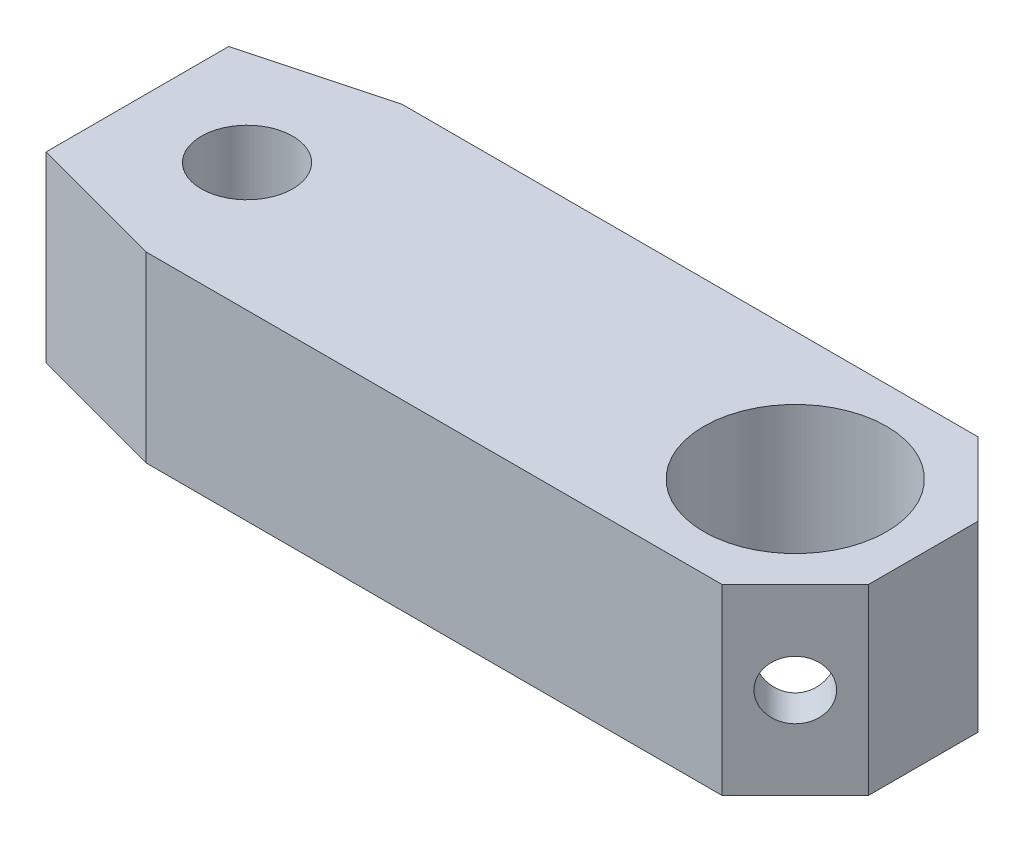
ISO-10303-21;
HEADER;
FILE_DESCRIPTION(('STEP AP214'),'2;1');
FILE_NAME('part.step','',(''),(''),'','','');
FILE_SCHEMA(('AUTOMOTIVE_DESIGN { 1 0 10303 214 1 1 1 1 }'));
ENDSEC;
DATA;
#1=APPLICATION_CONTEXT('core data for automotive mechanical design processes');
#2=APPLICATION_PROTOCOL_DEFINITION('international standard','automotive_design',2000,#1);
#3=PRODUCT_CONTEXT('',#1,'mechanical');
#4=PRODUCT('Part','Part','',(#3));
#5=PRODUCT_RELATED_PRODUCT_CATEGORY('part','',(#4));
#6=PRODUCT_DEFINITION_FORMATION('','',#4);
#7=PRODUCT_DEFINITION_CONTEXT('part definition',#1,'design');
#8=PRODUCT_DEFINITION('design','',#6,#7);
#9=PRODUCT_DEFINITION_SHAPE('','',#8);
#10=(LENGTH_UNIT() NAMED_UNIT(*) SI_UNIT(.MILLI.,.METRE.));
#11=(NAMED_UNIT(*) PLANE_ANGLE_UNIT() SI_UNIT($,.RADIAN.));
#12=(NAMED_UNIT(*) SI_UNIT($,.STERADIAN.) SOLID_ANGLE_UNIT());
#13=UNCERTAINTY_MEASURE_WITH_UNIT(LENGTH_MEASURE(1.E-05),#10,'distance_accuracy_value','');
#14=(GEOMETRIC_REPRESENTATION_CONTEXT(3) GLOBAL_UNCERTAINTY_ASSIGNED_CONTEXT((#13)) GLOBAL_UNIT_ASSIGNED_CONTEXT((#10,
#11,#12)) REPRESENTATION_CONTEXT('',''));
#15=CARTESIAN_POINT('',(0.,0.,0.));
#16=DIRECTION('',(0.,0.,1.));
#17=DIRECTION('',(1.,0.,0.));
#18=AXIS2_PLACEMENT_3D('',#15,#16,#17);
#19=CARTESIAN_POINT('',(10.,-5.,-10.));
#20=DIRECTION('',(-0.707106781186548,0.,0.707106781186547));
#21=DIRECTION('',(0.707106781186547,0.,0.707106781186548));
#22=AXIS2_PLACEMENT_3D('',#19,#20,#21);
#23=PLANE('',#22);
#24=DIRECTION('',(0.707106781186547,0.,0.707106781186548));
#25=VECTOR('',#24,1.);
#26=CARTESIAN_POINT('',(10.,0.,-10.));
#27=LINE('',#26,#25);
#28=CARTESIAN_POINT('',(16.5,0.,-3.5));
#29=VERTEX_POINT('',#28);
#30=CARTESIAN_POINT('',(18.5,0.,-1.5));
#31=VERTEX_POINT('',#30);
#32=EDGE_CURVE('E150',#29,#31,#27,.T.);
#33=ORIENTED_EDGE('',*,*,#32,.T.);
#34=DIRECTION('',(0.,1.,0.));
#35=VECTOR('',#34,1.);
#36=CARTESIAN_POINT('',(18.5,-5.,-1.5));
#37=LINE('',#36,#35);
#38=CARTESIAN_POINT('',(18.5,-5.,-1.5));
#39=VERTEX_POINT('',#38);
#40=EDGE_CURVE('E168',#39,#31,#37,.T.);
#41=ORIENTED_EDGE('',*,*,#40,.F.);
#42=DIRECTION('',(0.707106781186547,0.,0.707106781186548));
#43=VECTOR('',#42,1.);
#44=CARTESIAN_POINT('',(10.,-5.,-10.));
#45=LINE('',#44,#43);
#46=CARTESIAN_POINT('',(16.5,-5.,-3.5));
#47=VERTEX_POINT('',#46);
#48=EDGE_CURVE('E132',#47,#39,#45,.T.);
#49=ORIENTED_EDGE('',*,*,#48,.F.);
#50=DIRECTION('',(0.,1.,0.));
#51=VECTOR('',#50,1.);
#52=CARTESIAN_POINT('',(16.5,-5.,-3.5));
#53=LINE('',#52,#51);
#54=EDGE_CURVE('E165',#47,#29,#53,.T.);
#55=ORIENTED_EDGE('',*,*,#54,.T.);
#56=EDGE_LOOP('',(#33,#41,#49,#55));
#57=FACE_BOUND('',#56,.T.);
#58=CARTESIAN_POINT('',(17.5,-2.5,-2.5));
#59=DIRECTION('',(0.707106781186549,0.,-0.707106781186546));
#60=DIRECTION('',(-0.707106781186546,0.,-0.707106781186549));
#61=AXIS2_PLACEMENT_3D('',#58,#59,#60);
#62=CIRCLE('',#61,0.799999999999998);
#63=CARTESIAN_POINT('',(16.9343145750508,-2.5,-3.06568542494924));
#64=VERTEX_POINT('',#63);
#65=EDGE_CURVE('E216',#64,#64,#62,.T.);
#66=ORIENTED_EDGE('',*,*,#65,.F.);
#67=EDGE_LOOP('',(#66));
#68=FACE_BOUND('',#67,.T.);
#69=ADVANCED_FACE('F39',(#57,#68),#23,.F.);
#70=CARTESIAN_POINT('',(0.,-5.,3.5));
#71=DIRECTION('',(0.,0.,1.));
#72=DIRECTION('',(1.,0.,0.));
#73=AXIS2_PLACEMENT_3D('',#70,#71,#72);
#74=PLANE('',#73);
#75=DIRECTION('',(1.,0.,0.));
#76=VECTOR('',#75,1.);
#77=CARTESIAN_POINT('',(0.,0.,3.5));
#78=LINE('',#77,#76);
#79=CARTESIAN_POINT('',(0.732050807568831,0.,3.5));
#80=VERTEX_POINT('',#79);
#81=CARTESIAN_POINT('',(16.5,0.,3.5));
#82=VERTEX_POINT('',#81);
#83=EDGE_CURVE('E140',#80,#82,#78,.T.);
#84=ORIENTED_EDGE('',*,*,#83,.F.);
#85=DIRECTION('',(0.,1.,0.));
#86=VECTOR('',#85,1.);
#87=CARTESIAN_POINT('',(0.732050807568831,-5.,3.5));
#88=LINE('',#87,#86);
#89=CARTESIAN_POINT('',(0.732050807568831,-5.,3.5));
#90=VERTEX_POINT('',#89);
#91=EDGE_CURVE('E11',#90,#80,#88,.T.);
#92=ORIENTED_EDGE('',*,*,#91,.F.);
#93=DIRECTION('',(1.,0.,0.));
#94=VECTOR('',#93,1.);
#95=CARTESIAN_POINT('',(0.,-5.,3.5));
#96=LINE('',#95,#94);
#97=CARTESIAN_POINT('',(16.5,-5.,3.5));
#98=VERTEX_POINT('',#97);
#99=EDGE_CURVE('E173',#90,#98,#96,.T.);
#100=ORIENTED_EDGE('',*,*,#99,.T.);
#101=DIRECTION('',(0.,1.,0.));
#102=VECTOR('',#101,1.);
#103=CARTESIAN_POINT('',(16.5,-5.,3.5));
#104=LINE('',#103,#102);
#105=EDGE_CURVE('E43',#98,#82,#104,.T.);
#106=ORIENTED_EDGE('',*,*,#105,.T.);
#107=EDGE_LOOP('',(#84,#92,#100,#106));
#108=FACE_BOUND('',#107,.T.);
#109=ADVANCED_FACE('F172',(#108),#74,.T.);
#110=CARTESIAN_POINT('',(-0.825961894323354,-5.,3.08253175473055));
#111=DIRECTION('',(-0.258819045102524,0.,0.965925826289068));
#112=DIRECTION('',(0.965925826289068,0.,0.258819045102524));
#113=AXIS2_PLACEMENT_3D('',#110,#111,#112);
#114=PLANE('',#113);
#115=DIRECTION('',(0.965925826289068,0.,0.258819045102524));
#116=VECTOR('',#115,1.);
#117=CARTESIAN_POINT('',(-0.825961894323354,0.,3.08253175473055));
#118=LINE('',#117,#116);
#119=CARTESIAN_POINT('',(-3.,0.,2.5));
#120=VERTEX_POINT('',#119);
#121=EDGE_CURVE('E159',#120,#80,#118,.T.);
#122=ORIENTED_EDGE('',*,*,#121,.F.);
#123=DIRECTION('',(0.,1.,0.));
#124=VECTOR('',#123,1.);
#125=CARTESIAN_POINT('',(-3.,-5.,2.5));
#126=LINE('',#125,#124);
#127=CARTESIAN_POINT('',(-3.,-5.,2.5));
#128=VERTEX_POINT('',#127);
#129=EDGE_CURVE('E49',#128,#120,#126,.T.);
#130=ORIENTED_EDGE('',*,*,#129,.F.);
#131=DIRECTION('',(0.965925826289068,0.,0.258819045102524));
#132=VECTOR('',#131,1.);
#133=CARTESIAN_POINT('',(-0.825961894323354,-5.,3.08253175473055));
#134=LINE('',#133,#132);
#135=EDGE_CURVE('E126',#128,#90,#134,.T.);
#136=ORIENTED_EDGE('',*,*,#135,.T.);
#137=ORIENTED_EDGE('',*,*,#91,.T.);
#138=EDGE_LOOP('',(#122,#130,#136,#137));
#139=FACE_BOUND('',#138,.T.);
#140=ADVANCED_FACE('F177',(#139),#114,.T.);
#141=CARTESIAN_POINT('',(-3.,-5.,0.));
#142=DIRECTION('',(-1.,0.,0.));
#143=DIRECTION('',(0.,0.,1.));
#144=AXIS2_PLACEMENT_3D('',#141,#142,#143);
#145=PLANE('',#144);
#146=DIRECTION('',(0.,0.,1.));
#147=VECTOR('',#146,1.);
#148=CARTESIAN_POINT('',(-3.,0.,0.));
#149=LINE('',#148,#147);
#150=CARTESIAN_POINT('',(-3.,0.,-2.5));
#151=VERTEX_POINT('',#150);
#152=EDGE_CURVE('E114',#151,#120,#149,.T.);
#153=ORIENTED_EDGE('',*,*,#152,.F.);
#154=DIRECTION('',(0.,1.,0.));
#155=VECTOR('',#154,1.);
#156=CARTESIAN_POINT('',(-3.,-5.,-2.5));
#157=LINE('',#156,#155);
#158=CARTESIAN_POINT('',(-3.,-5.,-2.5));
#159=VERTEX_POINT('',#158);
#160=EDGE_CURVE('E109',#159,#151,#157,.T.);
#161=ORIENTED_EDGE('',*,*,#160,.F.);
#162=DIRECTION('',(0.,0.,1.));
#163=VECTOR('',#162,1.);
#164=CARTESIAN_POINT('',(-3.,-5.,0.));
#165=LINE('',#164,#163);
#166=EDGE_CURVE('E112',#159,#128,#165,.T.);
#167=ORIENTED_EDGE('',*,*,#166,.T.);
#168=ORIENTED_EDGE('',*,*,#129,.T.);
#169=EDGE_LOOP('',(#153,#161,#167,#168));
#170=FACE_BOUND('',#169,.T.);
#171=ADVANCED_FACE('F111',(#170),#145,.T.);
#172=CARTESIAN_POINT('',(-0.825961894323355,-5.,-3.08253175473055));
#173=DIRECTION('',(-0.258819045102524,0.,-0.965925826289068));
#174=DIRECTION('',(-0.965925826289068,0.,0.258819045102524));
#175=AXIS2_PLACEMENT_3D('',#172,#173,#174);
#176=PLANE('',#175);
#177=DIRECTION('',(-0.965925826289067,0.,0.258819045102524));
#178=VECTOR('',#177,1.);
#179=CARTESIAN_POINT('',(-0.825961894323355,0.,-3.08253175473055));
#180=LINE('',#179,#178);
#181=CARTESIAN_POINT('',(0.732050807568824,0.,-3.5));
#182=VERTEX_POINT('',#181);
#183=EDGE_CURVE('E156',#182,#151,#180,.T.);
#184=ORIENTED_EDGE('',*,*,#183,.F.);
#185=DIRECTION('',(0.,1.,0.));
#186=VECTOR('',#185,1.);
#187=CARTESIAN_POINT('',(0.732050807568824,-5.,-3.5));
#188=LINE('',#187,#186);
#189=CARTESIAN_POINT('',(0.732050807568824,-5.,-3.5));
#190=VERTEX_POINT('',#189);
#191=EDGE_CURVE('E119',#190,#182,#188,.T.);
#192=ORIENTED_EDGE('',*,*,#191,.F.);
#193=DIRECTION('',(-0.965925826289067,0.,0.258819045102524));
#194=VECTOR('',#193,1.);
#195=CARTESIAN_POINT('',(-0.825961894323355,-5.,-3.08253175473055));
#196=LINE('',#195,#194);
#197=EDGE_CURVE('E125',#190,#159,#196,.T.);
#198=ORIENTED_EDGE('',*,*,#197,.T.);
#199=ORIENTED_EDGE('',*,*,#160,.T.);
#200=EDGE_LOOP('',(#184,#192,#198,#199));
#201=FACE_BOUND('',#200,.T.);
#202=ADVANCED_FACE('F128',(#201),#176,.T.);
#203=CARTESIAN_POINT('',(0.,-5.,-3.5));
#204=DIRECTION('',(0.,0.,1.));
#205=DIRECTION('',(1.,0.,0.));
#206=AXIS2_PLACEMENT_3D('',#203,#204,#205);
#207=PLANE('',#206);
#208=DIRECTION('',(1.,0.,0.));
#209=VECTOR('',#208,1.);
#210=CARTESIAN_POINT('',(0.,0.,-3.5));
#211=LINE('',#210,#209);
#212=EDGE_CURVE('E153',#182,#29,#211,.T.);
#213=ORIENTED_EDGE('',*,*,#212,.T.);
#214=ORIENTED_EDGE('',*,*,#54,.F.);
#215=DIRECTION('',(1.,0.,0.));
#216=VECTOR('',#215,1.);
#217=CARTESIAN_POINT('',(0.,-5.,-3.5));
#218=LINE('',#217,#216);
#219=EDGE_CURVE('E130',#190,#47,#218,.T.);
#220=ORIENTED_EDGE('',*,*,#219,.F.);
#221=ORIENTED_EDGE('',*,*,#191,.T.);
#222=EDGE_LOOP('',(#213,#214,#220,#221));
#223=FACE_BOUND('',#222,.T.);
#224=ADVANCED_FACE('F194',(#223),#207,.F.);
#225=CARTESIAN_POINT('',(18.5,-5.,0.));
#226=DIRECTION('',(-1.,0.,0.));
#227=DIRECTION('',(0.,0.,1.));
#228=AXIS2_PLACEMENT_3D('',#225,#226,#227);
#229=PLANE('',#228);
#230=DIRECTION('',(0.,0.,1.));
#231=VECTOR('',#230,1.);
#232=CARTESIAN_POINT('',(18.5,0.,0.));
#233=LINE('',#232,#231);
#234=CARTESIAN_POINT('',(18.5,0.,1.50000000000001));
#235=VERTEX_POINT('',#234);
#236=EDGE_CURVE('E147',#31,#235,#233,.T.);
#237=ORIENTED_EDGE('',*,*,#236,.T.);
#238=DIRECTION('',(0.,1.,0.));
#239=VECTOR('',#238,1.);
#240=CARTESIAN_POINT('',(18.5,-5.,1.50000000000001));
#241=LINE('',#240,#239);
#242=CARTESIAN_POINT('',(18.5,-5.,1.50000000000001));
#243=VERTEX_POINT('',#242);
#244=EDGE_CURVE('E170',#243,#235,#241,.T.);
#245=ORIENTED_EDGE('',*,*,#244,.F.);
#246=DIRECTION('',(0.,0.,1.));
#247=VECTOR('',#246,1.);
#248=CARTESIAN_POINT('',(18.5,-5.,0.));
#249=LINE('',#248,#247);
#250=EDGE_CURVE('E272',#39,#243,#249,.T.);
#251=ORIENTED_EDGE('',*,*,#250,.F.);
#252=ORIENTED_EDGE('',*,*,#40,.T.);
#253=EDGE_LOOP('',(#237,#245,#251,#252));
#254=FACE_BOUND('',#253,.T.);
#255=ADVANCED_FACE('F196',(#254),#229,.F.);
#256=CARTESIAN_POINT('',(15.,-5.,0.));
#257=DIRECTION('',(0.,1.,0.));
#258=DIRECTION('',(0.,0.,1.));
#259=AXIS2_PLACEMENT_3D('',#256,#257,#258);
#260=CYLINDRICAL_SURFACE('',#259,2.5);
#261=CARTESIAN_POINT('',(17.2404988473937,-2.5,1.10912799749519));
#262=CARTESIAN_POINT('',(17.2404988541167,-2.4563168810223,1.10912818541871));
#263=CARTESIAN_POINT('',(17.2388241767648,-2.41263224816393,1.1125304018607));
#264=CARTESIAN_POINT('',(17.232113868879,-2.32655020622629,1.12593179470893));
#265=CARTESIAN_POINT('',(17.2270774585958,-2.28415309817247,1.13593250161976));
#266=CARTESIAN_POINT('',(17.2136215489733,-2.20190594916675,1.16193440751882));
#267=CARTESIAN_POINT('',(17.2052082599999,-2.16205138734552,1.17792458777334));
#268=CARTESIAN_POINT('',(17.1849436904651,-2.08579117949244,1.21509982738939));
#269=CARTESIAN_POINT('',(17.1730917474474,-2.0493861998166,1.23628588761476));
#270=CARTESIAN_POINT('',(17.1454440363891,-1.97974680243317,1.2836842202225));
#271=CARTESIAN_POINT('',(17.1295320197195,-1.94665491726237,1.31003814826472));
#272=CARTESIAN_POINT('',(17.0939436171637,-1.88585678706832,1.36620054517443));
#273=CARTESIAN_POINT('',(17.0742666794856,-1.85815133268898,1.3960095201654));
#274=CARTESIAN_POINT('',(17.0306971684241,-1.80827730734993,1.45868354616379));
#275=CARTESIAN_POINT('',(17.0067153046472,-1.78625642534535,1.4916044987244));
#276=CARTESIAN_POINT('',(16.9551367795838,-1.7493507180172,1.55859681671745));
#277=CARTESIAN_POINT('',(16.9275410137925,-1.73446412911867,1.5926678956108));
#278=CARTESIAN_POINT('',(16.8702109889945,-1.71272811038582,1.65957469045755));
#279=CARTESIAN_POINT('',(16.84057444976,-1.7056348711692,1.69241479802919));
#280=CARTESIAN_POINT('',(16.7791781047093,-1.69891344724945,1.7568447522647));
#281=CARTESIAN_POINT('',(16.7474188061002,-1.6992834855991,1.78843489474068));
#282=CARTESIAN_POINT('',(16.683936611475,-1.70731975098619,1.84829473803465));
#283=CARTESIAN_POINT('',(16.6522539768443,-1.71472149892031,1.87664322380571));
#284=CARTESIAN_POINT('',(16.5888369923934,-1.73617591162057,1.93062999064361));
#285=CARTESIAN_POINT('',(16.5571026392871,-1.75022901682797,1.95626809209598));
#286=CARTESIAN_POINT('',(16.4942370738243,-1.78475161625891,2.00470732303012));
#287=CARTESIAN_POINT('',(16.4631184679375,-1.80529959079679,2.02746871397409));
#288=CARTESIAN_POINT('',(16.4029661086455,-1.85216510344927,2.06954961660544));
#289=CARTESIAN_POINT('',(16.3739329043215,-1.8784841537353,2.08886822378477));
#290=CARTESIAN_POINT('',(16.3177886514939,-1.93749382086661,2.12475695925679));
#291=CARTESIAN_POINT('',(16.2908165726072,-1.97041218152882,2.14117055718036));
#292=CARTESIAN_POINT('',(16.2414015320426,-2.04099413048974,2.17019482644184));
#293=CARTESIAN_POINT('',(16.2189591592858,-2.0786583347775,2.18280500339054));
#294=CARTESIAN_POINT('',(16.1794287718536,-2.15827837014686,2.20441911446709));
#295=CARTESIAN_POINT('',(16.16240956869,-2.20028103768846,2.21337707737416));
#296=CARTESIAN_POINT('',(16.1350682749203,-2.28701040319528,2.2275232326676));
#297=CARTESIAN_POINT('',(16.1247436385431,-2.33173605859247,2.23271285814559));
#298=CARTESIAN_POINT('',(16.1117173070573,-2.4206319550402,2.23922659867746));
#299=CARTESIAN_POINT('',(16.1087140765745,-2.4647468241569,2.24070369973722));
#300=CARTESIAN_POINT('',(16.1096337901048,-2.55288213526822,2.24024851592345));
#301=CARTESIAN_POINT('',(16.1135555993644,-2.59690259155014,2.23831678962858));
#302=CARTESIAN_POINT('',(16.1278531023916,-2.68218851367629,2.23114483636998));
#303=CARTESIAN_POINT('',(16.1380263436639,-2.7234970733505,2.22600831940711));
#304=CARTESIAN_POINT('',(16.1640915190041,-2.80370557986887,2.21248842478181));
#305=CARTESIAN_POINT('',(16.1799844152127,-2.84260512018495,2.20410450083366));
#306=CARTESIAN_POINT('',(16.2172718927272,-2.91817392358121,2.18373807606431));
#307=CARTESIAN_POINT('',(16.2388162112165,-2.95474227940474,2.17165585061502));
#308=CARTESIAN_POINT('',(16.2862014947658,-3.02348671109181,2.14393050396678));
#309=CARTESIAN_POINT('',(16.3120436293921,-3.05566158700413,2.12828641304743));
#310=CARTESIAN_POINT('',(16.3682106614373,-3.11615955531712,2.0926422503481));
#311=CARTESIAN_POINT('',(16.3986822651239,-3.14425240079187,2.07248148247199));
#312=CARTESIAN_POINT('',(16.4619856153365,-3.19404253863835,2.02832079001999));
#313=CARTESIAN_POINT('',(16.4948172610245,-3.21574010406074,2.00432102941991));
#314=CARTESIAN_POINT('',(16.5613480340638,-3.25191799863386,1.9529322867102));
#315=CARTESIAN_POINT('',(16.5950392344851,-3.26644905920689,1.9255688928008));
#316=CARTESIAN_POINT('',(16.6622575220946,-3.28799205205537,1.86784880658013));
#317=CARTESIAN_POINT('',(16.6957846597637,-3.29500646366345,1.83749310487792));
#318=CARTESIAN_POINT('',(16.7600580359578,-3.30110785394987,1.77597545873001));
#319=CARTESIAN_POINT('',(16.7908617970982,-3.30052665751495,1.74490614639337));
#320=CARTESIAN_POINT('',(16.8503422443139,-3.29226145761088,1.68170050288552));
#321=CARTESIAN_POINT('',(16.8790190805558,-3.28457795609982,1.64956424727568));
#322=CARTESIAN_POINT('',(16.9331918914688,-3.26254086461702,1.58571746846321));
#323=CARTESIAN_POINT('',(16.9587259629554,-3.24827981377716,1.55400712571505));
#324=CARTESIAN_POINT('',(17.0066494650578,-3.21357669521386,1.49161230484144));
#325=CARTESIAN_POINT('',(17.0290383434733,-3.19313354408271,1.46092800757718));
#326=CARTESIAN_POINT('',(17.0711806033031,-3.14581944610727,1.40057618973544));
#327=CARTESIAN_POINT('',(17.0908141582918,-3.11874838189769,1.37098196334065));
#328=CARTESIAN_POINT('',(17.126412589917,-3.05929536207991,1.31509297148735));
#329=CARTESIAN_POINT('',(17.1423763395129,-3.02691178015333,1.28879922076634));
#330=CARTESIAN_POINT('',(17.1711562714463,-2.95638667718153,1.23972554536212));
#331=CARTESIAN_POINT('',(17.1838417540485,-2.91808249896281,1.21710204417814));
#332=CARTESIAN_POINT('',(17.2053683159992,-2.83760764716501,1.1776495007583));
#333=CARTESIAN_POINT('',(17.2142107619253,-2.79543835448412,1.16081839919842));
#334=CARTESIAN_POINT('',(17.2276249198159,-2.71150857944311,1.1348507413015));
#335=CARTESIAN_POINT('',(17.2324556973834,-2.66993242204363,1.12525198200641));
#336=CARTESIAN_POINT('',(17.2388922089384,-2.58557110057192,1.11239140019805));
#337=CARTESIAN_POINT('',(17.2404988408087,-2.54278627646441,1.10912781342986));
#338=CARTESIAN_POINT('',(17.2404988473937,-2.5,1.10912799749519));
#339=B_SPLINE_CURVE_WITH_KNOTS('',3,(#261,#262,#263,#264,#265,#266,#267,#268,#269,#270,#271,
#272,#273,#274,#275,#276,#277,#278,#279,#280,#281,#282,#283,#284,#285,#286,#287,#288,#289,#290,
#291,#292,#293,#294,#295,#296,#297,#298,#299,#300,#301,#302,#303,#304,#305,#306,#307,#308,#309,
#310,#311,#312,#313,#314,#315,#316,#317,#318,#319,#320,#321,#322,#323,#324,#325,#326,#327,#328,
#329,#330,#331,#332,#333,#334,#335,#336,#337,#338),.UNSPECIFIED.,.T.,.F.,(4,2,2,2,2,2,2,2,2,2,2,
2,2,2,2,2,2,2,2,2,2,2,2,2,2,2,2,2,2,2,2,2,2,2,2,2,2,2,4),(0.,0.130891168523663,
0.261812707628661,0.392494566159158,0.523201617269221,0.658181086047294,0.793180352769164,
0.931396887417822,1.06957923772489,1.20330337206031,1.33699566811544,1.46585063697654,
1.5947141395825,1.72519845034169,1.85571699231553,1.99192534158374,2.12815138832635,
2.26604280905129,2.40388176242564,2.53593995660066,2.66797651341177,2.79594728163428,
2.92393958672764,3.0557432663747,3.18758287266625,3.32519336185686,3.46279797482663,
3.59941398434423,3.73598491780592,3.86661026401423,3.99722637893302,4.12605842929881,
4.25491307046653,4.38828245677264,4.52169274783304,4.65980300496366,4.79786411004772,
4.92610371676323,5.05430760545675),.UNSPECIFIED.);
#340=CARTESIAN_POINT('',(17.2404988473937,-2.5,1.10912799749519));
#341=VERTEX_POINT('',#340);
#342=EDGE_CURVE('E213',#341,#341,#339,.T.);
#343=ORIENTED_EDGE('',*,*,#342,.T.);
#344=EDGE_LOOP('',(#343));
#345=FACE_BOUND('',#344,.T.);
#346=CARTESIAN_POINT('',(16.1091279974952,-2.5,-2.24049884739366));
#347=CARTESIAN_POINT('',(16.1091281854187,-2.4563168810223,-2.24049885411668));
#348=CARTESIAN_POINT('',(16.1125304018607,-2.41263224816393,-2.23882417676484));
#349=CARTESIAN_POINT('',(16.1259317947089,-2.32655020622629,-2.23211386887905));
#350=CARTESIAN_POINT('',(16.1359325016197,-2.28415309817247,-2.22707745859578));
#351=CARTESIAN_POINT('',(16.1619344075188,-2.20190594916675,-2.21362154897332));
#352=CARTESIAN_POINT('',(16.1779245877733,-2.16205138734552,-2.2052082599999));
#353=CARTESIAN_POINT('',(16.2150998273894,-2.08579117949244,-2.18494369046508));
#354=CARTESIAN_POINT('',(16.2362858876148,-2.0493861998166,-2.17309174744741));
#355=CARTESIAN_POINT('',(16.2836842202225,-1.97974680243317,-2.14544403638909));
#356=CARTESIAN_POINT('',(16.3100381482647,-1.94665491726237,-2.12953201971954));
#357=CARTESIAN_POINT('',(16.3662005451744,-1.88585678706832,-2.09394361716372));
#358=CARTESIAN_POINT('',(16.3960095201654,-1.85815133268898,-2.07426667948564));
#359=CARTESIAN_POINT('',(16.4586835461638,-1.80827730734993,-2.03069716842412));
#360=CARTESIAN_POINT('',(16.4916044987244,-1.78625642534535,-2.00671530464722));
#361=CARTESIAN_POINT('',(16.5585968167174,-1.74935071801721,-1.95513677958383));
#362=CARTESIAN_POINT('',(16.5926678956108,-1.73446412911867,-1.92754101379246));
#363=CARTESIAN_POINT('',(16.6595746904575,-1.71272811038582,-1.87021098899453));
#364=CARTESIAN_POINT('',(16.6924147980292,-1.7056348711692,-1.84057444976));
#365=CARTESIAN_POINT('',(16.7568447522647,-1.69891344724945,-1.77917810470935));
#366=CARTESIAN_POINT('',(16.7884348947407,-1.6992834855991,-1.74741880610021));
#367=CARTESIAN_POINT('',(16.8482947380346,-1.70731975098619,-1.68393661147496));
#368=CARTESIAN_POINT('',(16.8766432238057,-1.71472149892031,-1.65225397684429));
#369=CARTESIAN_POINT('',(16.9306299906436,-1.73617591162058,-1.58883699239339));
#370=CARTESIAN_POINT('',(16.956268092096,-1.75022901682797,-1.55710263928714));
#371=CARTESIAN_POINT('',(17.0047073230301,-1.78475161625891,-1.49423707382427));
#372=CARTESIAN_POINT('',(17.0274687139741,-1.80529959079679,-1.46311846793753));
#373=CARTESIAN_POINT('',(17.0695496166054,-1.85216510344927,-1.40296610864553));
#374=CARTESIAN_POINT('',(17.0888682237848,-1.8784841537353,-1.37393290432149));
#375=CARTESIAN_POINT('',(17.1247569592568,-1.93749382086661,-1.31778865149392));
#376=CARTESIAN_POINT('',(17.1411705571804,-1.97041218152882,-1.29081657260717));
#377=CARTESIAN_POINT('',(17.1701948264418,-2.04099413048974,-1.24140153204261));
#378=CARTESIAN_POINT('',(17.1828050033905,-2.0786583347775,-1.2189591592858));
#379=CARTESIAN_POINT('',(17.2044191144671,-2.15827837014686,-1.17942877185361));
#380=CARTESIAN_POINT('',(17.2133770773742,-2.20028103768846,-1.16240956869004));
#381=CARTESIAN_POINT('',(17.2275232326676,-2.28701040319528,-1.13506827492031));
#382=CARTESIAN_POINT('',(17.2327128581456,-2.33173605859247,-1.12474363854311));
#383=CARTESIAN_POINT('',(17.2392265986775,-2.4206319550402,-1.11171730705733));
#384=CARTESIAN_POINT('',(17.2407036997372,-2.4647468241569,-1.1087140765745));
#385=CARTESIAN_POINT('',(17.2402485159234,-2.55288213526821,-1.10963379010485));
#386=CARTESIAN_POINT('',(17.2383167896286,-2.59690259155014,-1.11355559936442));
#387=CARTESIAN_POINT('',(17.23114483637,-2.68218851367628,-1.12785310239162));
#388=CARTESIAN_POINT('',(17.2260083194071,-2.7234970733505,-1.13802634366389));
#389=CARTESIAN_POINT('',(17.2124884247818,-2.80370557986886,-1.16409151900411));
#390=CARTESIAN_POINT('',(17.2041045008337,-2.84260512018495,-1.17998441521267));
#391=CARTESIAN_POINT('',(17.1837380760643,-2.91817392358121,-1.21727189272725));
#392=CARTESIAN_POINT('',(17.171655850615,-2.95474227940474,-1.23881621121647));
#393=CARTESIAN_POINT('',(17.1439305039668,-3.02348671109181,-1.28620149476584));
#394=CARTESIAN_POINT('',(17.1282864130474,-3.05566158700413,-1.31204362939209));
#395=CARTESIAN_POINT('',(17.0926422503481,-3.11615955531712,-1.36821066143728));
#396=CARTESIAN_POINT('',(17.072481482472,-3.14425240079187,-1.3986822651239));
#397=CARTESIAN_POINT('',(17.02832079002,-3.19404253863835,-1.46198561533654));
#398=CARTESIAN_POINT('',(17.0043210294199,-3.21574010406074,-1.49481726102455));
#399=CARTESIAN_POINT('',(16.9529322867102,-3.25191799863386,-1.56134803406381));
#400=CARTESIAN_POINT('',(16.9255688928008,-3.26644905920689,-1.59503923448506));
#401=CARTESIAN_POINT('',(16.8678488065801,-3.28799205205537,-1.66225752209456));
#402=CARTESIAN_POINT('',(16.8374931048779,-3.29500646366345,-1.69578465976372));
#403=CARTESIAN_POINT('',(16.77597545873,-3.30110785394987,-1.76005803595779));
#404=CARTESIAN_POINT('',(16.7449061463934,-3.30052665751495,-1.79086179709819));
#405=CARTESIAN_POINT('',(16.6817005028855,-3.29226145761088,-1.85034224431393));
#406=CARTESIAN_POINT('',(16.6495642472757,-3.28457795609982,-1.87901908055577));
#407=CARTESIAN_POINT('',(16.5857174684632,-3.26254086461702,-1.9331918914688));
#408=CARTESIAN_POINT('',(16.554007125715,-3.24827981377717,-1.9587259629554));
#409=CARTESIAN_POINT('',(16.4916123048414,-3.21357669521386,-2.00664946505784));
#410=CARTESIAN_POINT('',(16.4609280075772,-3.19313354408271,-2.02903834347329));
#411=CARTESIAN_POINT('',(16.4005761897354,-3.14581944610727,-2.07118060330313));
#412=CARTESIAN_POINT('',(16.3709819633406,-3.11874838189769,-2.09081415829184));
#413=CARTESIAN_POINT('',(16.3150929714873,-3.05929536207992,-2.126412589917));
#414=CARTESIAN_POINT('',(16.2887992207663,-3.02691178015333,-2.14237633951295));
#415=CARTESIAN_POINT('',(16.2397255453621,-2.95638667718153,-2.17115627144635));
#416=CARTESIAN_POINT('',(16.2171020441781,-2.91808249896281,-2.18384175404855));
#417=CARTESIAN_POINT('',(16.1776495007583,-2.83760764716501,-2.20536831599921));
#418=CARTESIAN_POINT('',(16.1608183991984,-2.79543835448412,-2.21421076192526));
#419=CARTESIAN_POINT('',(16.1348507413015,-2.71150857944311,-2.22762491981589));
#420=CARTESIAN_POINT('',(16.1252519820064,-2.66993242204363,-2.23245569738337));
#421=CARTESIAN_POINT('',(16.112391400198,-2.58557110057192,-2.23889220893843));
#422=CARTESIAN_POINT('',(16.1091278134299,-2.54278627646441,-2.24049884080867));
#423=CARTESIAN_POINT('',(16.1091279974952,-2.5,-2.24049884739366));
#424=B_SPLINE_CURVE_WITH_KNOTS('',3,(#346,#347,#348,#349,#350,#351,#352,#353,#354,#355,#356,
#357,#358,#359,#360,#361,#362,#363,#364,#365,#366,#367,#368,#369,#370,#371,#372,#373,#374,#375,
#376,#377,#378,#379,#380,#381,#382,#383,#384,#385,#386,#387,#388,#389,#390,#391,#392,#393,#394,
#395,#396,#397,#398,#399,#400,#401,#402,#403,#404,#405,#406,#407,#408,#409,#410,#411,#412,#413,
#414,#415,#416,#417,#418,#419,#420,#421,#422,#423),.UNSPECIFIED.,.T.,.F.,(4,2,2,2,2,2,2,2,2,2,2,
2,2,2,2,2,2,2,2,2,2,2,2,2,2,2,2,2,2,2,2,2,2,2,2,2,2,2,4),(0.,0.130891168523662,0.26181270762866,
0.392494566159156,0.523201617269218,0.658181086047291,0.793180352769161,0.931396887417819,
1.06957923772489,1.20330337206031,1.33699566811544,1.46585063697655,1.5947141395825,
1.72519845034169,1.85571699231554,1.99192534158374,2.12815138832635,2.26604280905129,
2.40388176242564,2.53593995660066,2.66797651341177,2.79594728163428,2.92393958672764,
3.0557432663747,3.18758287266625,3.32519336185686,3.46279797482663,3.59941398434423,
3.73598491780592,3.86661026401423,3.99722637893302,4.12605842929881,4.25491307046653,
4.38828245677263,4.52169274783304,4.65980300496366,4.79786411004772,4.92610371676324,
5.05430760545675),.UNSPECIFIED.);
#425=CARTESIAN_POINT('',(16.1091279974952,-2.5,-2.24049884739366));
#426=VERTEX_POINT('',#425);
#427=EDGE_CURVE('E242',#426,#426,#424,.T.);
#428=ORIENTED_EDGE('',*,*,#427,.T.);
#429=EDGE_LOOP('',(#428));
#430=FACE_BOUND('',#429,.T.);
#431=CARTESIAN_POINT('',(15.,-5.,0.));
#432=DIRECTION('',(0.,1.,0.));
#433=DIRECTION('',(0.,0.,1.));
#434=AXIS2_PLACEMENT_3D('',#431,#432,#433);
#435=CIRCLE('',#434,2.5);
#436=CARTESIAN_POINT('',(15.,-5.,2.5));
#437=VERTEX_POINT('',#436);
#438=EDGE_CURVE('E161',#437,#437,#435,.T.);
#439=ORIENTED_EDGE('',*,*,#438,.F.);
#440=EDGE_LOOP('',(#439));
#441=FACE_BOUND('',#440,.T.);
#442=CARTESIAN_POINT('',(15.,0.,0.));
#443=DIRECTION('',(0.,1.,0.));
#444=DIRECTION('',(0.,0.,1.));
#445=AXIS2_PLACEMENT_3D('',#442,#443,#444);
#446=CIRCLE('',#445,2.5);
#447=CARTESIAN_POINT('',(15.,0.,2.5));
#448=VERTEX_POINT('',#447);
#449=EDGE_CURVE('E137',#448,#448,#446,.T.);
#450=ORIENTED_EDGE('',*,*,#449,.T.);
#451=EDGE_LOOP('',(#450));
#452=FACE_BOUND('',#451,.T.);
#453=ADVANCED_FACE('F41',(#345,#430,#441,#452),#260,.F.);
#454=CARTESIAN_POINT('',(9.99999999999996,-5.,10.));
#455=DIRECTION('',(0.707106781186546,0.,0.707106781186549));
#456=DIRECTION('',(0.707106781186549,0.,-0.707106781186546));
#457=AXIS2_PLACEMENT_3D('',#454,#455,#456);
#458=PLANE('',#457);
#459=CARTESIAN_POINT('',(17.5,-2.5,2.5));
#460=DIRECTION('',(0.707106781186549,0.,0.707106781186546));
#461=DIRECTION('',(0.707106781186546,0.,-0.707106781186549));
#462=AXIS2_PLACEMENT_3D('',#459,#460,#461);
#463=CIRCLE('',#462,0.799999999999998);
#464=CARTESIAN_POINT('',(18.0656854249492,-2.5,1.93431457505076));
#465=VERTEX_POINT('',#464);
#466=EDGE_CURVE('E211',#465,#465,#463,.T.);
#467=ORIENTED_EDGE('',*,*,#466,.F.);
#468=EDGE_LOOP('',(#467));
#469=FACE_BOUND('',#468,.T.);
#470=DIRECTION('',(0.707106781186549,0.,-0.707106781186546));
#471=VECTOR('',#470,1.);
#472=CARTESIAN_POINT('',(9.99999999999996,0.,10.));
#473=LINE('',#472,#471);
#474=EDGE_CURVE('E144',#82,#235,#473,.T.);
#475=ORIENTED_EDGE('',*,*,#474,.F.);
#476=ORIENTED_EDGE('',*,*,#105,.F.);
#477=DIRECTION('',(0.707106781186549,0.,-0.707106781186546));
#478=VECTOR('',#477,1.);
#479=CARTESIAN_POINT('',(9.99999999999996,-5.,10.));
#480=LINE('',#479,#478);
#481=EDGE_CURVE('E270',#98,#243,#480,.T.);
#482=ORIENTED_EDGE('',*,*,#481,.T.);
#483=ORIENTED_EDGE('',*,*,#244,.T.);
#484=EDGE_LOOP('',(#475,#476,#482,#483));
#485=FACE_BOUND('',#484,.T.);
#486=ADVANCED_FACE('F174',(#469,#485),#458,.T.);
#487=CARTESIAN_POINT('',(0.,-5.,0.));
#488=DIRECTION('',(0.,1.,0.));
#489=DIRECTION('',(0.,0.,1.));
#490=AXIS2_PLACEMENT_3D('',#487,#488,#489);
#491=PLANE('',#490);
#492=CARTESIAN_POINT('',(0.,-5.,0.));
#493=DIRECTION('',(0.,1.,0.));
#494=DIRECTION('',(0.,0.,1.));
#495=AXIS2_PLACEMENT_3D('',#492,#493,#494);
#496=CIRCLE('',#495,1.25);
#497=CARTESIAN_POINT('',(0.,-5.,1.25));
#498=VERTEX_POINT('',#497);
#499=EDGE_CURVE('E141',#498,#498,#496,.T.);
#500=ORIENTED_EDGE('',*,*,#499,.T.);
#501=EDGE_LOOP('',(#500));
#502=FACE_BOUND('',#501,.T.);
#503=ORIENTED_EDGE('',*,*,#438,.T.);
#504=EDGE_LOOP('',(#503));
#505=FACE_BOUND('',#504,.T.);
#506=ORIENTED_EDGE('',*,*,#99,.F.);
#507=ORIENTED_EDGE('',*,*,#135,.F.);
#508=ORIENTED_EDGE('',*,*,#166,.F.);
#509=ORIENTED_EDGE('',*,*,#197,.F.);
#510=ORIENTED_EDGE('',*,*,#219,.T.);
#511=ORIENTED_EDGE('',*,*,#48,.T.);
#512=ORIENTED_EDGE('',*,*,#250,.T.);
#513=ORIENTED_EDGE('',*,*,#481,.F.);
#514=EDGE_LOOP('',(#506,#507,#508,#509,#510,#511,#512,#513));
#515=FACE_BOUND('',#514,.T.);
#516=ADVANCED_FACE('F123',(#502,#505,#515),#491,.F.);
#517=CARTESIAN_POINT('',(0.,0.,0.));
#518=DIRECTION('',(0.,1.,0.));
#519=DIRECTION('',(0.,0.,1.));
#520=AXIS2_PLACEMENT_3D('',#517,#518,#519);
#521=PLANE('',#520);
#522=CARTESIAN_POINT('',(0.,0.,0.));
#523=DIRECTION('',(0.,1.,0.));
#524=DIRECTION('',(0.,0.,1.));
#525=AXIS2_PLACEMENT_3D('',#522,#523,#524);
#526=CIRCLE('',#525,1.25);
#527=CARTESIAN_POINT('',(0.,0.,1.25));
#528=VERTEX_POINT('',#527);
#529=EDGE_CURVE('E263',#528,#528,#526,.T.);
#530=ORIENTED_EDGE('',*,*,#529,.F.);
#531=EDGE_LOOP('',(#530));
#532=FACE_BOUND('',#531,.T.);
#533=ORIENTED_EDGE('',*,*,#449,.F.);
#534=EDGE_LOOP('',(#533));
#535=FACE_BOUND('',#534,.T.);
#536=ORIENTED_EDGE('',*,*,#83,.T.);
#537=ORIENTED_EDGE('',*,*,#474,.T.);
#538=ORIENTED_EDGE('',*,*,#236,.F.);
#539=ORIENTED_EDGE('',*,*,#32,.F.);
#540=ORIENTED_EDGE('',*,*,#212,.F.);
#541=ORIENTED_EDGE('',*,*,#183,.T.);
#542=ORIENTED_EDGE('',*,*,#152,.T.);
#543=ORIENTED_EDGE('',*,*,#121,.T.);
#544=EDGE_LOOP('',(#536,#537,#538,#539,#540,#541,#542,#543));
#545=FACE_BOUND('',#544,.T.);
#546=ADVANCED_FACE('F176',(#532,#535,#545),#521,.T.);
#547=CARTESIAN_POINT('',(0.,0.,0.));
#548=DIRECTION('',(0.,1.,0.));
#549=DIRECTION('',(0.,0.,1.));
#550=AXIS2_PLACEMENT_3D('',#547,#548,#549);
#551=CYLINDRICAL_SURFACE('',#550,1.25);
#552=ORIENTED_EDGE('',*,*,#499,.F.);
#553=EDGE_LOOP('',(#552));
#554=FACE_BOUND('',#553,.T.);
#555=ORIENTED_EDGE('',*,*,#529,.T.);
#556=EDGE_LOOP('',(#555));
#557=FACE_BOUND('',#556,.T.);
#558=ADVANCED_FACE('F235',(#554,#557),#551,.F.);
#559=CARTESIAN_POINT('',(17.5,-2.5,-2.5));
#560=DIRECTION('',(0.707106781186549,0.,-0.707106781186546));
#561=DIRECTION('',(-0.707106781186546,0.,-0.707106781186549));
#562=AXIS2_PLACEMENT_3D('',#559,#560,#561);
#563=CYLINDRICAL_SURFACE('',#562,0.799999999999999);
#564=ORIENTED_EDGE('',*,*,#427,.F.);
#565=EDGE_LOOP('',(#564));
#566=FACE_BOUND('',#565,.T.);
#567=ORIENTED_EDGE('',*,*,#65,.T.);
#568=EDGE_LOOP('',(#567));
#569=FACE_BOUND('',#568,.T.);
#570=ADVANCED_FACE('F230',(#566,#569),#563,.F.);
#571=CARTESIAN_POINT('',(17.5,-2.5,2.5));
#572=DIRECTION('',(0.707106781186549,0.,0.707106781186546));
#573=DIRECTION('',(0.707106781186546,0.,-0.707106781186549));
#574=AXIS2_PLACEMENT_3D('',#571,#572,#573);
#575=CYLINDRICAL_SURFACE('',#574,0.799999999999999);
#576=ORIENTED_EDGE('',*,*,#342,.F.);
#577=EDGE_LOOP('',(#576));
#578=FACE_BOUND('',#577,.T.);
#579=ORIENTED_EDGE('',*,*,#466,.T.);
#580=EDGE_LOOP('',(#579));
#581=FACE_BOUND('',#580,.T.);
#582=ADVANCED_FACE('F227',(#578,#581),#575,.F.);
#583=CLOSED_SHELL('',(#69,#109,#140,#171,#202,#224,#255,#453,#486,#516,#546,#558,#570,#582));
#584=MANIFOLD_SOLID_BREP('B2',#583);
#585=ADVANCED_BREP_SHAPE_REPRESENTATION('',(#18,#584),#14);
#586=SHAPE_DEFINITION_REPRESENTATION(#9,#585);
ENDSEC;
END-ISO-10303-21;
